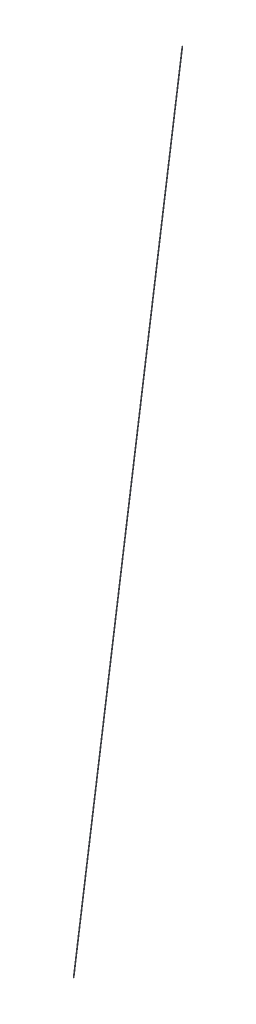
ISO-10303-21;
HEADER;
FILE_DESCRIPTION(('STEP AP214'),'2;1');
FILE_NAME('part.step','',(''),(''),'','','');
FILE_SCHEMA(('AUTOMOTIVE_DESIGN { 1 0 10303 214 1 1 1 1 }'));
ENDSEC;
DATA;
#1=APPLICATION_CONTEXT('core data for automotive mechanical design processes');
#2=APPLICATION_PROTOCOL_DEFINITION('international standard','automotive_design',2000,#1);
#3=PRODUCT_CONTEXT('',#1,'mechanical');
#4=PRODUCT('Part','Part','',(#3));
#5=PRODUCT_RELATED_PRODUCT_CATEGORY('part','',(#4));
#6=PRODUCT_DEFINITION_FORMATION('','',#4);
#7=PRODUCT_DEFINITION_CONTEXT('part definition',#1,'design');
#8=PRODUCT_DEFINITION('design','',#6,#7);
#9=PRODUCT_DEFINITION_SHAPE('','',#8);
#10=(LENGTH_UNIT() NAMED_UNIT(*) SI_UNIT(.MILLI.,.METRE.));
#11=(NAMED_UNIT(*) PLANE_ANGLE_UNIT() SI_UNIT($,.RADIAN.));
#12=(NAMED_UNIT(*) SI_UNIT($,.STERADIAN.) SOLID_ANGLE_UNIT());
#13=UNCERTAINTY_MEASURE_WITH_UNIT(LENGTH_MEASURE(1.E-05),#10,'distance_accuracy_value','');
#14=(GEOMETRIC_REPRESENTATION_CONTEXT(3) GLOBAL_UNCERTAINTY_ASSIGNED_CONTEXT((#13)) GLOBAL_UNIT_ASSIGNED_CONTEXT((#10,
#11,#12)) REPRESENTATION_CONTEXT('',''));
#15=CARTESIAN_POINT('',(0.,0.,0.));
#16=DIRECTION('',(0.,0.,1.));
#17=DIRECTION('',(1.,0.,0.));
#18=AXIS2_PLACEMENT_3D('',#15,#16,#17);
#19=CARTESIAN_POINT('',(0.,1505.,0.));
#20=DIRECTION('',(0.,-0.989718015570063,0.143032337798331));
#21=DIRECTION('',(0.,-0.143032337798331,-0.989718015570063));
#22=AXIS2_PLACEMENT_3D('',#19,#20,#21);
#23=PLANE('',#22);
#24=CARTESIAN_POINT('',(0.,1505.,0.));
#25=DIRECTION('',(0.,-0.989718015570063,0.143032337798331));
#26=DIRECTION('',(0.,-0.143032337798331,-0.989718015570063));
#27=AXIS2_PLACEMENT_3D('',#24,#25,#26);
#28=CIRCLE('',#27,0.5);
#29=CARTESIAN_POINT('',(0.,1504.9284838311,-0.49485900778506));
#30=VERTEX_POINT('',#29);
#31=EDGE_CURVE('E47',#30,#30,#28,.T.);
#32=ORIENTED_EDGE('',*,*,#31,.F.);
#33=EDGE_LOOP('',(#32));
#34=FACE_BOUND('',#33,.T.);
#35=ADVANCED_FACE('F41',(#34),#23,.F.);
#36=CARTESIAN_POINT('',(0.,0.,217.5));
#37=DIRECTION('',(0.,-0.989718015570063,0.143032337798331));
#38=DIRECTION('',(0.,-0.143032337798331,-0.989718015570063));
#39=AXIS2_PLACEMENT_3D('',#36,#37,#38);
#40=PLANE('',#39);
#41=CARTESIAN_POINT('',(0.,0.,217.5));
#42=DIRECTION('',(0.,-0.989718015570063,0.143032337798331));
#43=DIRECTION('',(0.,-0.143032337798331,-0.989718015570063));
#44=AXIS2_PLACEMENT_3D('',#41,#42,#43);
#45=CIRCLE('',#44,0.5);
#46=CARTESIAN_POINT('',(0.,-0.0715161688991657,217.005140992215));
#47=VERTEX_POINT('',#46);
#48=EDGE_CURVE('E11',#47,#47,#45,.T.);
#49=ORIENTED_EDGE('',*,*,#48,.T.);
#50=EDGE_LOOP('',(#49));
#51=FACE_BOUND('',#50,.T.);
#52=ADVANCED_FACE('F56',(#51),#40,.T.);
#53=CARTESIAN_POINT('',(0.,1505.,0.));
#54=DIRECTION('',(0.,-0.989718015570063,0.143032337798331));
#55=DIRECTION('',(0.,-0.143032337798331,-0.989718015570063));
#56=AXIS2_PLACEMENT_3D('',#53,#54,#55);
#57=CYLINDRICAL_SURFACE('',#56,0.5);
#58=ORIENTED_EDGE('',*,*,#48,.F.);
#59=EDGE_LOOP('',(#58));
#60=FACE_BOUND('',#59,.T.);
#61=ORIENTED_EDGE('',*,*,#31,.T.);
#62=EDGE_LOOP('',(#61));
#63=FACE_BOUND('',#62,.T.);
#64=ADVANCED_FACE('F53',(#60,#63),#57,.T.);
#65=CLOSED_SHELL('',(#35,#52,#64));
#66=MANIFOLD_SOLID_BREP('B2',#65);
#67=ADVANCED_BREP_SHAPE_REPRESENTATION('',(#18,#66),#14);
#68=SHAPE_DEFINITION_REPRESENTATION(#9,#67);
ENDSEC;
END-ISO-10303-21;
